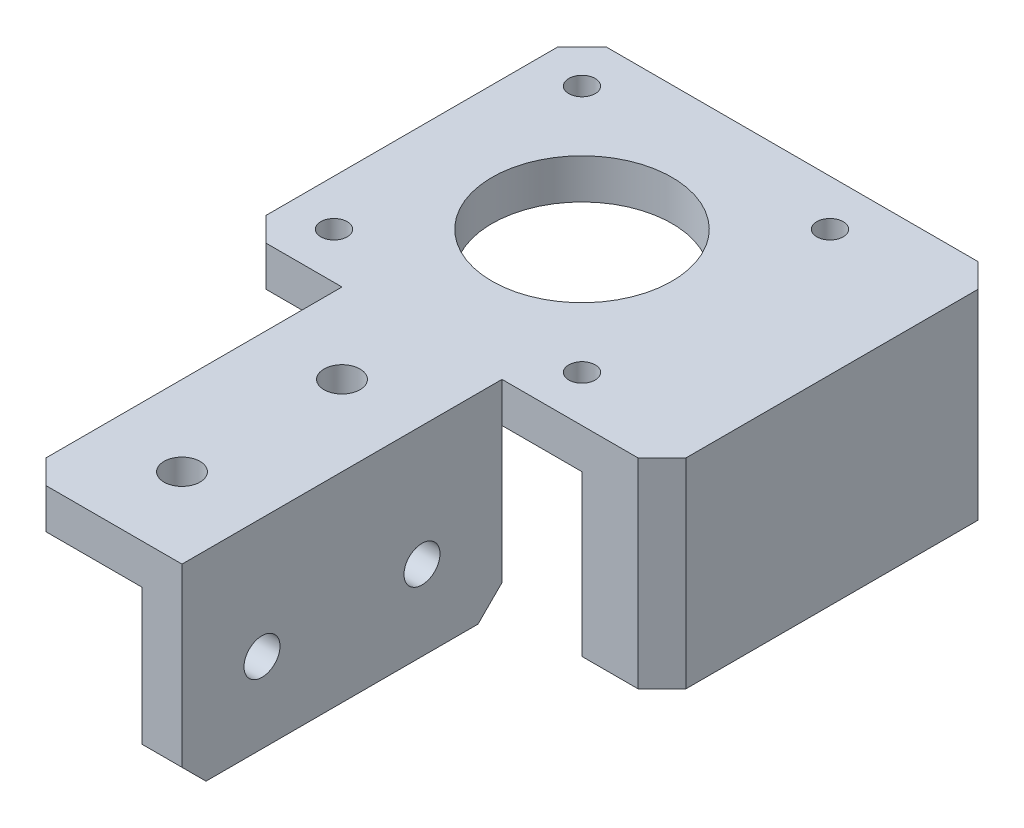
ISO-10303-21;
HEADER;
FILE_DESCRIPTION(('STEP AP214'),'2;1');
FILE_NAME('part.step','',(''),(''),'','','');
FILE_SCHEMA(('AUTOMOTIVE_DESIGN { 1 0 10303 214 1 1 1 1 }'));
ENDSEC;
DATA;
#1=APPLICATION_CONTEXT('core data for automotive mechanical design processes');
#2=APPLICATION_PROTOCOL_DEFINITION('international standard','automotive_design',2000,#1);
#3=PRODUCT_CONTEXT('',#1,'mechanical');
#4=PRODUCT('Part','Part','',(#3));
#5=PRODUCT_RELATED_PRODUCT_CATEGORY('part','',(#4));
#6=PRODUCT_DEFINITION_FORMATION('','',#4);
#7=PRODUCT_DEFINITION_CONTEXT('part definition',#1,'design');
#8=PRODUCT_DEFINITION('design','',#6,#7);
#9=PRODUCT_DEFINITION_SHAPE('','',#8);
#10=(LENGTH_UNIT() NAMED_UNIT(*) SI_UNIT(.MILLI.,.METRE.));
#11=(NAMED_UNIT(*) PLANE_ANGLE_UNIT() SI_UNIT($,.RADIAN.));
#12=(NAMED_UNIT(*) SI_UNIT($,.STERADIAN.) SOLID_ANGLE_UNIT());
#13=UNCERTAINTY_MEASURE_WITH_UNIT(LENGTH_MEASURE(1.E-05),#10,'distance_accuracy_value','');
#14=(GEOMETRIC_REPRESENTATION_CONTEXT(3) GLOBAL_UNCERTAINTY_ASSIGNED_CONTEXT((#13)) GLOBAL_UNIT_ASSIGNED_CONTEXT((#10,
#11,#12)) REPRESENTATION_CONTEXT('',''));
#15=CARTESIAN_POINT('',(0.,0.,0.));
#16=DIRECTION('',(0.,0.,1.));
#17=DIRECTION('',(1.,0.,0.));
#18=AXIS2_PLACEMENT_3D('',#15,#16,#17);
#19=CARTESIAN_POINT('',(31.251,-10.,31.25));
#20=DIRECTION('',(-1.,0.,0.));
#21=DIRECTION('',(0.,0.,1.));
#22=AXIS2_PLACEMENT_3D('',#19,#20,#21);
#23=CYLINDRICAL_SURFACE('',#22,2.25);
#24=CARTESIAN_POINT('',(11.25,-10.,31.25));
#25=DIRECTION('',(1.,0.,0.));
#26=DIRECTION('',(0.,0.,-1.));
#27=AXIS2_PLACEMENT_3D('',#24,#25,#26);
#28=CIRCLE('',#27,2.25);
#29=CARTESIAN_POINT('',(11.25,-10.,29.));
#30=VERTEX_POINT('',#29);
#31=EDGE_CURVE('E326',#30,#30,#28,.F.);
#32=ORIENTED_EDGE('',*,*,#31,.F.);
#33=EDGE_LOOP('',(#32));
#34=FACE_BOUND('',#33,.T.);
#35=CARTESIAN_POINT('',(7.25,-10.,31.25));
#36=DIRECTION('',(-1.,0.,0.));
#37=DIRECTION('',(0.,0.,1.));
#38=AXIS2_PLACEMENT_3D('',#35,#36,#37);
#39=CIRCLE('',#38,2.25);
#40=CARTESIAN_POINT('',(7.25,-10.,33.5));
#41=VERTEX_POINT('',#40);
#42=EDGE_CURVE('E330',#41,#41,#39,.F.);
#43=ORIENTED_EDGE('',*,*,#42,.F.);
#44=EDGE_LOOP('',(#43));
#45=FACE_BOUND('',#44,.T.);
#46=ADVANCED_FACE('F34',(#34,#45),#23,.F.);
#47=CARTESIAN_POINT('',(31.251,-10.,51.25));
#48=DIRECTION('',(-1.,0.,0.));
#49=DIRECTION('',(0.,0.,1.));
#50=AXIS2_PLACEMENT_3D('',#47,#48,#49);
#51=CYLINDRICAL_SURFACE('',#50,2.25);
#52=CARTESIAN_POINT('',(11.25,-10.,51.25));
#53=DIRECTION('',(1.,0.,0.));
#54=DIRECTION('',(0.,0.,-1.));
#55=AXIS2_PLACEMENT_3D('',#52,#53,#54);
#56=CIRCLE('',#55,2.25);
#57=CARTESIAN_POINT('',(11.25,-10.,49.));
#58=VERTEX_POINT('',#57);
#59=EDGE_CURVE('E378',#58,#58,#56,.F.);
#60=ORIENTED_EDGE('',*,*,#59,.F.);
#61=EDGE_LOOP('',(#60));
#62=FACE_BOUND('',#61,.T.);
#63=CARTESIAN_POINT('',(7.25,-10.,51.25));
#64=DIRECTION('',(-1.,0.,0.));
#65=DIRECTION('',(0.,0.,1.));
#66=AXIS2_PLACEMENT_3D('',#63,#64,#65);
#67=CIRCLE('',#66,2.25);
#68=CARTESIAN_POINT('',(7.25,-10.,53.5));
#69=VERTEX_POINT('',#68);
#70=EDGE_CURVE('E327',#69,#69,#67,.F.);
#71=ORIENTED_EDGE('',*,*,#70,.F.);
#72=EDGE_LOOP('',(#71));
#73=FACE_BOUND('',#72,.T.);
#74=ADVANCED_FACE('F440',(#62,#73),#51,.F.);
#75=CARTESIAN_POINT('',(1.25,-20.001,31.25));
#76=DIRECTION('',(0.,1.,0.));
#77=DIRECTION('',(0.,0.,1.));
#78=AXIS2_PLACEMENT_3D('',#75,#76,#77);
#79=CYLINDRICAL_SURFACE('',#78,2.25);
#80=CARTESIAN_POINT('',(1.25,5.,31.25));
#81=DIRECTION('',(0.,1.,0.));
#82=DIRECTION('',(0.,0.,-1.));
#83=AXIS2_PLACEMENT_3D('',#80,#81,#82);
#84=CIRCLE('',#83,2.25);
#85=CARTESIAN_POINT('',(1.25,5.,29.));
#86=VERTEX_POINT('',#85);
#87=EDGE_CURVE('E375',#86,#86,#84,.T.);
#88=ORIENTED_EDGE('',*,*,#87,.T.);
#89=EDGE_LOOP('',(#88));
#90=FACE_BOUND('',#89,.T.);
#91=CARTESIAN_POINT('',(1.25,1.,31.25));
#92=DIRECTION('',(0.,-1.,0.));
#93=DIRECTION('',(0.,0.,-1.));
#94=AXIS2_PLACEMENT_3D('',#91,#92,#93);
#95=CIRCLE('',#94,2.25);
#96=CARTESIAN_POINT('',(1.25,1.,29.));
#97=VERTEX_POINT('',#96);
#98=EDGE_CURVE('E322',#97,#97,#95,.F.);
#99=ORIENTED_EDGE('',*,*,#98,.F.);
#100=EDGE_LOOP('',(#99));
#101=FACE_BOUND('',#100,.T.);
#102=ADVANCED_FACE('F447',(#90,#101),#79,.F.);
#103=CARTESIAN_POINT('',(1.25,-20.001,51.25));
#104=DIRECTION('',(0.,1.,0.));
#105=DIRECTION('',(0.,0.,1.));
#106=AXIS2_PLACEMENT_3D('',#103,#104,#105);
#107=CYLINDRICAL_SURFACE('',#106,2.25);
#108=CARTESIAN_POINT('',(1.25,5.,51.25));
#109=DIRECTION('',(0.,1.,0.));
#110=DIRECTION('',(0.,0.,1.));
#111=AXIS2_PLACEMENT_3D('',#108,#109,#110);
#112=CIRCLE('',#111,2.25);
#113=CARTESIAN_POINT('',(1.25,5.,53.5));
#114=VERTEX_POINT('',#113);
#115=EDGE_CURVE('E368',#114,#114,#112,.T.);
#116=ORIENTED_EDGE('',*,*,#115,.T.);
#117=EDGE_LOOP('',(#116));
#118=FACE_BOUND('',#117,.T.);
#119=CARTESIAN_POINT('',(1.25,1.,51.25));
#120=DIRECTION('',(0.,-1.,0.));
#121=DIRECTION('',(0.,0.,-1.));
#122=AXIS2_PLACEMENT_3D('',#119,#120,#121);
#123=CIRCLE('',#122,2.25);
#124=CARTESIAN_POINT('',(1.25,1.,49.));
#125=VERTEX_POINT('',#124);
#126=EDGE_CURVE('E319',#125,#125,#123,.F.);
#127=ORIENTED_EDGE('',*,*,#126,.F.);
#128=EDGE_LOOP('',(#127));
#129=FACE_BOUND('',#128,.T.);
#130=ADVANCED_FACE('F454',(#118,#129),#107,.F.);
#131=CARTESIAN_POINT('',(-21.25,5.,21.25));
#132=DIRECTION('',(0.,0.,-1.));
#133=DIRECTION('',(-1.,0.,0.));
#134=AXIS2_PLACEMENT_3D('',#131,#132,#133);
#135=PLANE('',#134);
#136=DIRECTION('',(0.,-1.,0.));
#137=VECTOR('',#136,1.);
#138=CARTESIAN_POINT('',(-8.75,0.,21.25));
#139=LINE('',#138,#137);
#140=CARTESIAN_POINT('',(-8.75,5.,21.25));
#141=VERTEX_POINT('',#140);
#142=CARTESIAN_POINT('',(-8.75,0.,21.25));
#143=VERTEX_POINT('',#142);
#144=EDGE_CURVE('E367',#141,#143,#139,.T.);
#145=ORIENTED_EDGE('',*,*,#144,.F.);
#146=DIRECTION('',(1.,0.,0.));
#147=VECTOR('',#146,1.);
#148=CARTESIAN_POINT('',(-21.25,5.,21.25));
#149=LINE('',#148,#147);
#150=CARTESIAN_POINT('',(-18.25,5.,21.25));
#151=VERTEX_POINT('',#150);
#152=EDGE_CURVE('E268',#151,#141,#149,.T.);
#153=ORIENTED_EDGE('',*,*,#152,.F.);
#154=DIRECTION('',(0.,-1.,0.));
#155=VECTOR('',#154,1.);
#156=CARTESIAN_POINT('',(-18.25,5.,21.25));
#157=LINE('',#156,#155);
#158=CARTESIAN_POINT('',(-18.25,0.,21.25));
#159=VERTEX_POINT('',#158);
#160=EDGE_CURVE('E315',#151,#159,#157,.T.);
#161=ORIENTED_EDGE('',*,*,#160,.T.);
#162=DIRECTION('',(1.,0.,0.));
#163=VECTOR('',#162,1.);
#164=CARTESIAN_POINT('',(-21.25,0.,21.25));
#165=LINE('',#164,#163);
#166=EDGE_CURVE('E264',#159,#143,#165,.T.);
#167=ORIENTED_EDGE('',*,*,#166,.T.);
#168=EDGE_LOOP('',(#145,#153,#161,#167));
#169=FACE_BOUND('',#168,.T.);
#170=ADVANCED_FACE('F420',(#169),#135,.F.);
#171=CARTESIAN_POINT('',(6.25,-20.,21.25));
#172=DIRECTION('',(-1.,0.,0.));
#173=DIRECTION('',(0.,0.,1.));
#174=AXIS2_PLACEMENT_3D('',#171,#172,#173);
#175=PLANE('',#174);
#176=CARTESIAN_POINT('',(6.25,-10.,31.25));
#177=DIRECTION('',(-1.,0.,0.));
#178=DIRECTION('',(0.,0.,1.));
#179=AXIS2_PLACEMENT_3D('',#176,#177,#178);
#180=CIRCLE('',#179,3.75);
#181=CARTESIAN_POINT('',(6.25,-10.,35.));
#182=VERTEX_POINT('',#181);
#183=EDGE_CURVE('E401',#182,#182,#180,.T.);
#184=ORIENTED_EDGE('',*,*,#183,.F.);
#185=EDGE_LOOP('',(#184));
#186=FACE_BOUND('',#185,.T.);
#187=CARTESIAN_POINT('',(6.25,-10.,51.25));
#188=DIRECTION('',(-1.,0.,0.));
#189=DIRECTION('',(0.,0.,1.));
#190=AXIS2_PLACEMENT_3D('',#187,#188,#189);
#191=CIRCLE('',#190,3.75000000000001);
#192=CARTESIAN_POINT('',(6.25,-10.,55.));
#193=VERTEX_POINT('',#192);
#194=EDGE_CURVE('E395',#193,#193,#191,.T.);
#195=ORIENTED_EDGE('',*,*,#194,.F.);
#196=EDGE_LOOP('',(#195));
#197=FACE_BOUND('',#196,.T.);
#198=DIRECTION('',(0.,0.,1.));
#199=VECTOR('',#198,1.);
#200=CARTESIAN_POINT('',(6.25,-20.,21.25));
#201=LINE('',#200,#199);
#202=CARTESIAN_POINT('',(6.25,-20.,24.25));
#203=VERTEX_POINT('',#202);
#204=CARTESIAN_POINT('',(6.25,-20.,58.25));
#205=VERTEX_POINT('',#204);
#206=EDGE_CURVE('E199',#203,#205,#201,.T.);
#207=ORIENTED_EDGE('',*,*,#206,.T.);
#208=DIRECTION('',(0.,0.707106781186548,0.707106781186548));
#209=VECTOR('',#208,1.);
#210=CARTESIAN_POINT('',(6.25,-38.5,39.75));
#211=LINE('',#210,#209);
#212=CARTESIAN_POINT('',(6.25,-17.,61.25));
#213=VERTEX_POINT('',#212);
#214=EDGE_CURVE('E43',#205,#213,#211,.T.);
#215=ORIENTED_EDGE('',*,*,#214,.T.);
#216=DIRECTION('',(0.,1.,0.));
#217=VECTOR('',#216,1.);
#218=CARTESIAN_POINT('',(6.25,-20.,61.25));
#219=LINE('',#218,#217);
#220=CARTESIAN_POINT('',(6.25,0.,61.25));
#221=VERTEX_POINT('',#220);
#222=EDGE_CURVE('E183',#213,#221,#219,.T.);
#223=ORIENTED_EDGE('',*,*,#222,.T.);
#224=DIRECTION('',(0.,0.,1.));
#225=VECTOR('',#224,1.);
#226=CARTESIAN_POINT('',(6.25,0.,21.25));
#227=LINE('',#226,#225);
#228=CARTESIAN_POINT('',(6.25,0.,21.25));
#229=VERTEX_POINT('',#228);
#230=EDGE_CURVE('E365',#229,#221,#227,.T.);
#231=ORIENTED_EDGE('',*,*,#230,.F.);
#232=DIRECTION('',(0.,1.,0.));
#233=VECTOR('',#232,1.);
#234=CARTESIAN_POINT('',(6.25,-20.,21.25));
#235=LINE('',#234,#233);
#236=CARTESIAN_POINT('',(6.25,-17.,21.25));
#237=VERTEX_POINT('',#236);
#238=EDGE_CURVE('E205',#237,#229,#235,.T.);
#239=ORIENTED_EDGE('',*,*,#238,.F.);
#240=DIRECTION('',(0.,-0.707106781186548,0.707106781186548));
#241=VECTOR('',#240,1.);
#242=CARTESIAN_POINT('',(6.25,-18.5,22.75));
#243=LINE('',#242,#241);
#244=EDGE_CURVE('E50',#237,#203,#243,.T.);
#245=ORIENTED_EDGE('',*,*,#244,.T.);
#246=EDGE_LOOP('',(#207,#215,#223,#231,#239,#245));
#247=FACE_BOUND('',#246,.T.);
#248=ADVANCED_FACE('F352',(#186,#197,#247),#175,.T.);
#249=DIRECTION('',(1.,0.,0.));
#250=VECTOR('',#249,1.);
#251=CARTESIAN_POINT('',(21.25,-20.,21.25));
#252=LINE('',#251,#250);
#253=CARTESIAN_POINT('',(21.25,-20.,21.25));
#254=VERTEX_POINT('',#253);
#255=CARTESIAN_POINT('',(28.25,-20.,21.25));
#256=VERTEX_POINT('',#255);
#257=EDGE_CURVE('E215',#254,#256,#252,.T.);
#258=ORIENTED_EDGE('',*,*,#257,.T.);
#259=DIRECTION('',(0.,1.,0.));
#260=VECTOR('',#259,1.);
#261=CARTESIAN_POINT('',(28.25,5.,21.25));
#262=LINE('',#261,#260);
#263=CARTESIAN_POINT('',(28.25,5.,21.25));
#264=VERTEX_POINT('',#263);
#265=EDGE_CURVE('E282',#256,#264,#262,.T.);
#266=ORIENTED_EDGE('',*,*,#265,.T.);
#267=CARTESIAN_POINT('',(11.25,5.,21.25));
#268=VERTEX_POINT('',#267);
#269=EDGE_CURVE('E267',#268,#264,#149,.T.);
#270=ORIENTED_EDGE('',*,*,#269,.F.);
#271=DIRECTION('',(0.,1.,0.));
#272=VECTOR('',#271,1.);
#273=CARTESIAN_POINT('',(11.25,-20.,21.25));
#274=LINE('',#273,#272);
#275=CARTESIAN_POINT('',(11.25,0.,21.25));
#276=VERTEX_POINT('',#275);
#277=EDGE_CURVE('E198',#276,#268,#274,.T.);
#278=ORIENTED_EDGE('',*,*,#277,.F.);
#279=CARTESIAN_POINT('',(21.25,0.,21.25));
#280=VERTEX_POINT('',#279);
#281=EDGE_CURVE('E279',#276,#280,#165,.T.);
#282=ORIENTED_EDGE('',*,*,#281,.T.);
#283=DIRECTION('',(0.,1.,0.));
#284=VECTOR('',#283,1.);
#285=CARTESIAN_POINT('',(21.25,-20.,21.25));
#286=LINE('',#285,#284);
#287=EDGE_CURVE('E224',#254,#280,#286,.T.);
#288=ORIENTED_EDGE('',*,*,#287,.F.);
#289=EDGE_LOOP('',(#258,#266,#270,#278,#282,#288));
#290=FACE_BOUND('',#289,.T.);
#291=ADVANCED_FACE('F419',(#290),#135,.F.);
#292=CARTESIAN_POINT('',(0.,5.,0.));
#293=DIRECTION('',(0.,-1.,0.));
#294=DIRECTION('',(0.,0.,-1.));
#295=AXIS2_PLACEMENT_3D('',#292,#293,#294);
#296=PLANE('',#295);
#297=ORIENTED_EDGE('',*,*,#115,.F.);
#298=EDGE_LOOP('',(#297));
#299=FACE_BOUND('',#298,.T.);
#300=ORIENTED_EDGE('',*,*,#87,.F.);
#301=EDGE_LOOP('',(#300));
#302=FACE_BOUND('',#301,.T.);
#303=DIRECTION('',(0.,0.,-1.));
#304=VECTOR('',#303,1.);
#305=CARTESIAN_POINT('',(-8.75,5.,21.25));
#306=LINE('',#305,#304);
#307=CARTESIAN_POINT('',(-8.74999999999999,5.,58.25));
#308=VERTEX_POINT('',#307);
#309=EDGE_CURVE('E364',#308,#141,#306,.T.);
#310=ORIENTED_EDGE('',*,*,#309,.F.);
#311=DIRECTION('',(0.707106781186549,0.,0.707106781186546));
#312=VECTOR('',#311,1.);
#313=CARTESIAN_POINT('',(-8.74999999999999,5.,58.25));
#314=LINE('',#313,#312);
#315=CARTESIAN_POINT('',(-5.74999999999996,5.,61.25));
#316=VERTEX_POINT('',#315);
#317=EDGE_CURVE('E193',#308,#316,#314,.T.);
#318=ORIENTED_EDGE('',*,*,#317,.T.);
#319=DIRECTION('',(1.,0.,0.));
#320=VECTOR('',#319,1.);
#321=CARTESIAN_POINT('',(6.25,5.,61.25));
#322=LINE('',#321,#320);
#323=CARTESIAN_POINT('',(11.25,5.,61.25));
#324=VERTEX_POINT('',#323);
#325=EDGE_CURVE('E175',#316,#324,#322,.T.);
#326=ORIENTED_EDGE('',*,*,#325,.T.);
#327=DIRECTION('',(0.,0.,-1.));
#328=VECTOR('',#327,1.);
#329=CARTESIAN_POINT('',(11.25,5.,21.25));
#330=LINE('',#329,#328);
#331=EDGE_CURVE('E191',#324,#268,#330,.T.);
#332=ORIENTED_EDGE('',*,*,#331,.T.);
#333=ORIENTED_EDGE('',*,*,#269,.T.);
#334=DIRECTION('',(0.707106781186547,0.,-0.707106781186548));
#335=VECTOR('',#334,1.);
#336=CARTESIAN_POINT('',(28.25,5.,21.25));
#337=LINE('',#336,#335);
#338=CARTESIAN_POINT('',(31.25,5.,18.25));
#339=VERTEX_POINT('',#338);
#340=EDGE_CURVE('E291',#264,#339,#337,.T.);
#341=ORIENTED_EDGE('',*,*,#340,.T.);
#342=DIRECTION('',(0.,0.,-1.));
#343=VECTOR('',#342,1.);
#344=CARTESIAN_POINT('',(31.25,5.,21.25));
#345=LINE('',#344,#343);
#346=CARTESIAN_POINT('',(31.25,5.,-18.25));
#347=VERTEX_POINT('',#346);
#348=EDGE_CURVE('E207',#339,#347,#345,.T.);
#349=ORIENTED_EDGE('',*,*,#348,.T.);
#350=DIRECTION('',(-0.707106781186547,0.,-0.707106781186548));
#351=VECTOR('',#350,1.);
#352=CARTESIAN_POINT('',(31.25,5.,-18.25));
#353=LINE('',#352,#351);
#354=CARTESIAN_POINT('',(28.25,5.,-21.25));
#355=VERTEX_POINT('',#354);
#356=EDGE_CURVE('E289',#347,#355,#353,.T.);
#357=ORIENTED_EDGE('',*,*,#356,.T.);
#358=DIRECTION('',(-1.,0.,0.));
#359=VECTOR('',#358,1.);
#360=CARTESIAN_POINT('',(-21.25,5.,-21.25));
#361=LINE('',#360,#359);
#362=CARTESIAN_POINT('',(-18.25,5.,-21.25));
#363=VERTEX_POINT('',#362);
#364=EDGE_CURVE('E260',#355,#363,#361,.T.);
#365=ORIENTED_EDGE('',*,*,#364,.T.);
#366=DIRECTION('',(0.707106781186548,0.,-0.707106781186548));
#367=VECTOR('',#366,1.);
#368=CARTESIAN_POINT('',(-21.25,5.,-18.25));
#369=LINE('',#368,#367);
#370=CARTESIAN_POINT('',(-21.25,5.,-18.25));
#371=VERTEX_POINT('',#370);
#372=EDGE_CURVE('E287',#363,#371,#369,.F.);
#373=ORIENTED_EDGE('',*,*,#372,.T.);
#374=DIRECTION('',(0.,0.,1.));
#375=VECTOR('',#374,1.);
#376=CARTESIAN_POINT('',(-21.25,5.,21.25));
#377=LINE('',#376,#375);
#378=CARTESIAN_POINT('',(-21.25,5.,18.25));
#379=VERTEX_POINT('',#378);
#380=EDGE_CURVE('E263',#371,#379,#377,.T.);
#381=ORIENTED_EDGE('',*,*,#380,.T.);
#382=DIRECTION('',(-0.707106781186548,0.,-0.707106781186548));
#383=VECTOR('',#382,1.);
#384=CARTESIAN_POINT('',(-18.25,5.,21.25));
#385=LINE('',#384,#383);
#386=EDGE_CURVE('E285',#379,#151,#385,.F.);
#387=ORIENTED_EDGE('',*,*,#386,.T.);
#388=ORIENTED_EDGE('',*,*,#152,.T.);
#389=EDGE_LOOP('',(#310,#318,#326,#332,#333,#341,#349,#357,#365,#373,#381,#387,#388));
#390=FACE_BOUND('',#389,.T.);
#391=CARTESIAN_POINT('',(0.,5.,0.));
#392=DIRECTION('',(0.,1.,0.));
#393=DIRECTION('',(0.,0.,1.));
#394=AXIS2_PLACEMENT_3D('',#391,#392,#393);
#395=CIRCLE('',#394,11.25);
#396=CARTESIAN_POINT('',(0.,5.,11.25));
#397=VERTEX_POINT('',#396);
#398=EDGE_CURVE('E254',#397,#397,#395,.T.);
#399=ORIENTED_EDGE('',*,*,#398,.F.);
#400=EDGE_LOOP('',(#399));
#401=FACE_BOUND('',#400,.T.);
#402=CARTESIAN_POINT('',(-15.5,5.,-15.5));
#403=DIRECTION('',(0.,1.,0.));
#404=DIRECTION('',(0.,0.,1.));
#405=AXIS2_PLACEMENT_3D('',#402,#403,#404);
#406=CIRCLE('',#405,1.65);
#407=CARTESIAN_POINT('',(-15.5,5.,-13.85));
#408=VERTEX_POINT('',#407);
#409=EDGE_CURVE('E248',#408,#408,#406,.T.);
#410=ORIENTED_EDGE('',*,*,#409,.F.);
#411=EDGE_LOOP('',(#410));
#412=FACE_BOUND('',#411,.T.);
#413=CARTESIAN_POINT('',(15.5,5.,-15.5));
#414=DIRECTION('',(0.,1.,0.));
#415=DIRECTION('',(0.,0.,-1.));
#416=AXIS2_PLACEMENT_3D('',#413,#414,#415);
#417=CIRCLE('',#416,1.65);
#418=CARTESIAN_POINT('',(15.5,5.,-17.15));
#419=VERTEX_POINT('',#418);
#420=EDGE_CURVE('E242',#419,#419,#417,.T.);
#421=ORIENTED_EDGE('',*,*,#420,.F.);
#422=EDGE_LOOP('',(#421));
#423=FACE_BOUND('',#422,.T.);
#424=CARTESIAN_POINT('',(15.5,5.,15.5));
#425=DIRECTION('',(0.,1.,0.));
#426=DIRECTION('',(0.,0.,1.));
#427=AXIS2_PLACEMENT_3D('',#424,#425,#426);
#428=CIRCLE('',#427,1.65);
#429=CARTESIAN_POINT('',(15.5,5.,17.15));
#430=VERTEX_POINT('',#429);
#431=EDGE_CURVE('E236',#430,#430,#428,.T.);
#432=ORIENTED_EDGE('',*,*,#431,.F.);
#433=EDGE_LOOP('',(#432));
#434=FACE_BOUND('',#433,.T.);
#435=CARTESIAN_POINT('',(-15.5,5.,15.5));
#436=DIRECTION('',(0.,1.,0.));
#437=DIRECTION('',(0.,0.,-1.));
#438=AXIS2_PLACEMENT_3D('',#435,#436,#437);
#439=CIRCLE('',#438,1.65);
#440=CARTESIAN_POINT('',(-15.5,5.,13.85));
#441=VERTEX_POINT('',#440);
#442=EDGE_CURVE('E230',#441,#441,#439,.T.);
#443=ORIENTED_EDGE('',*,*,#442,.F.);
#444=EDGE_LOOP('',(#443));
#445=FACE_BOUND('',#444,.T.);
#446=ADVANCED_FACE('F188',(#299,#302,#390,#401,#412,#423,#434,#445),#296,.F.);
#447=CARTESIAN_POINT('',(0.,0.,0.));
#448=DIRECTION('',(0.,-1.,0.));
#449=DIRECTION('',(0.,0.,-1.));
#450=AXIS2_PLACEMENT_3D('',#447,#448,#449);
#451=PLANE('',#450);
#452=CARTESIAN_POINT('',(1.25,0.,51.25));
#453=DIRECTION('',(0.,-1.,0.));
#454=DIRECTION('',(0.,0.,-1.));
#455=AXIS2_PLACEMENT_3D('',#452,#453,#454);
#456=CIRCLE('',#455,3.75);
#457=CARTESIAN_POINT('',(1.25,0.,47.5));
#458=VERTEX_POINT('',#457);
#459=EDGE_CURVE('E390',#458,#458,#456,.T.);
#460=ORIENTED_EDGE('',*,*,#459,.F.);
#461=EDGE_LOOP('',(#460));
#462=FACE_BOUND('',#461,.T.);
#463=CARTESIAN_POINT('',(1.25000000000021,0.,31.25));
#464=DIRECTION('',(0.,-1.,0.));
#465=DIRECTION('',(0.,0.,-1.));
#466=AXIS2_PLACEMENT_3D('',#463,#464,#465);
#467=CIRCLE('',#466,3.75);
#468=CARTESIAN_POINT('',(1.25000000000021,0.,27.5));
#469=VERTEX_POINT('',#468);
#470=EDGE_CURVE('E334',#469,#469,#467,.T.);
#471=ORIENTED_EDGE('',*,*,#470,.F.);
#472=EDGE_LOOP('',(#471));
#473=FACE_BOUND('',#472,.T.);
#474=CARTESIAN_POINT('',(15.5,0.,15.5));
#475=DIRECTION('',(0.,1.,0.));
#476=DIRECTION('',(0.,0.,1.));
#477=AXIS2_PLACEMENT_3D('',#474,#475,#476);
#478=CIRCLE('',#477,1.65);
#479=CARTESIAN_POINT('',(15.5,0.,17.15));
#480=VERTEX_POINT('',#479);
#481=EDGE_CURVE('E233',#480,#480,#478,.T.);
#482=ORIENTED_EDGE('',*,*,#481,.T.);
#483=EDGE_LOOP('',(#482));
#484=FACE_BOUND('',#483,.T.);
#485=CARTESIAN_POINT('',(-15.5,0.,-15.5));
#486=DIRECTION('',(0.,1.,0.));
#487=DIRECTION('',(0.,0.,1.));
#488=AXIS2_PLACEMENT_3D('',#485,#486,#487);
#489=CIRCLE('',#488,1.65);
#490=CARTESIAN_POINT('',(-15.5,0.,-13.85));
#491=VERTEX_POINT('',#490);
#492=EDGE_CURVE('E245',#491,#491,#489,.T.);
#493=ORIENTED_EDGE('',*,*,#492,.T.);
#494=EDGE_LOOP('',(#493));
#495=FACE_BOUND('',#494,.T.);
#496=DIRECTION('',(1.,0.,0.));
#497=VECTOR('',#496,1.);
#498=CARTESIAN_POINT('',(-8.74999999999999,0.,61.25));
#499=LINE('',#498,#497);
#500=CARTESIAN_POINT('',(-5.74999999999996,0.,61.25));
#501=VERTEX_POINT('',#500);
#502=EDGE_CURVE('E194',#501,#221,#499,.T.);
#503=ORIENTED_EDGE('',*,*,#502,.F.);
#504=DIRECTION('',(-0.707106781186549,0.,-0.707106781186546));
#505=VECTOR('',#504,1.);
#506=CARTESIAN_POINT('',(-33.5,0.,33.5000000000001));
#507=LINE('',#506,#505);
#508=CARTESIAN_POINT('',(-8.74999999999999,0.,58.25));
#509=VERTEX_POINT('',#508);
#510=EDGE_CURVE('E341',#501,#509,#507,.T.);
#511=ORIENTED_EDGE('',*,*,#510,.T.);
#512=DIRECTION('',(0.,0.,1.));
#513=VECTOR('',#512,1.);
#514=CARTESIAN_POINT('',(-8.75,0.,21.25));
#515=LINE('',#514,#513);
#516=EDGE_CURVE('E370',#143,#509,#515,.T.);
#517=ORIENTED_EDGE('',*,*,#516,.F.);
#518=ORIENTED_EDGE('',*,*,#166,.F.);
#519=DIRECTION('',(0.707106781186548,0.,0.707106781186548));
#520=VECTOR('',#519,1.);
#521=CARTESIAN_POINT('',(-19.75,0.,19.75));
#522=LINE('',#521,#520);
#523=CARTESIAN_POINT('',(-21.25,0.,18.25));
#524=VERTEX_POINT('',#523);
#525=EDGE_CURVE('E311',#159,#524,#522,.F.);
#526=ORIENTED_EDGE('',*,*,#525,.T.);
#527=DIRECTION('',(0.,0.,1.));
#528=VECTOR('',#527,1.);
#529=CARTESIAN_POINT('',(-21.25,0.,21.25));
#530=LINE('',#529,#528);
#531=CARTESIAN_POINT('',(-21.25,0.,-18.25));
#532=VERTEX_POINT('',#531);
#533=EDGE_CURVE('E276',#532,#524,#530,.T.);
#534=ORIENTED_EDGE('',*,*,#533,.F.);
#535=DIRECTION('',(-0.707106781186548,0.,0.707106781186548));
#536=VECTOR('',#535,1.);
#537=CARTESIAN_POINT('',(-19.75,0.,-19.75));
#538=LINE('',#537,#536);
#539=CARTESIAN_POINT('',(-18.25,0.,-21.25));
#540=VERTEX_POINT('',#539);
#541=EDGE_CURVE('E313',#532,#540,#538,.F.);
#542=ORIENTED_EDGE('',*,*,#541,.T.);
#543=DIRECTION('',(-1.,0.,0.));
#544=VECTOR('',#543,1.);
#545=CARTESIAN_POINT('',(-21.25,0.,-21.25));
#546=LINE('',#545,#544);
#547=CARTESIAN_POINT('',(21.25,0.,-21.25));
#548=VERTEX_POINT('',#547);
#549=EDGE_CURVE('E273',#548,#540,#546,.T.);
#550=ORIENTED_EDGE('',*,*,#549,.F.);
#551=DIRECTION('',(0.,0.,-1.));
#552=VECTOR('',#551,1.);
#553=CARTESIAN_POINT('',(21.25,0.,21.25));
#554=LINE('',#553,#552);
#555=EDGE_CURVE('E257',#280,#548,#554,.T.);
#556=ORIENTED_EDGE('',*,*,#555,.F.);
#557=ORIENTED_EDGE('',*,*,#281,.F.);
#558=EDGE_CURVE('E281',#229,#276,#165,.T.);
#559=ORIENTED_EDGE('',*,*,#558,.F.);
#560=ORIENTED_EDGE('',*,*,#230,.T.);
#561=EDGE_LOOP('',(#503,#511,#517,#518,#526,#534,#542,#550,#556,#557,#559,#560));
#562=FACE_BOUND('',#561,.T.);
#563=CARTESIAN_POINT('',(0.,0.,0.));
#564=DIRECTION('',(0.,1.,0.));
#565=DIRECTION('',(0.,0.,1.));
#566=AXIS2_PLACEMENT_3D('',#563,#564,#565);
#567=CIRCLE('',#566,11.25);
#568=CARTESIAN_POINT('',(0.,0.,11.25));
#569=VERTEX_POINT('',#568);
#570=EDGE_CURVE('E251',#569,#569,#567,.T.);
#571=ORIENTED_EDGE('',*,*,#570,.T.);
#572=EDGE_LOOP('',(#571));
#573=FACE_BOUND('',#572,.T.);
#574=CARTESIAN_POINT('',(15.5,0.,-15.5));
#575=DIRECTION('',(0.,1.,0.));
#576=DIRECTION('',(0.,0.,-1.));
#577=AXIS2_PLACEMENT_3D('',#574,#575,#576);
#578=CIRCLE('',#577,1.65);
#579=CARTESIAN_POINT('',(15.5,0.,-17.15));
#580=VERTEX_POINT('',#579);
#581=EDGE_CURVE('E239',#580,#580,#578,.T.);
#582=ORIENTED_EDGE('',*,*,#581,.T.);
#583=EDGE_LOOP('',(#582));
#584=FACE_BOUND('',#583,.T.);
#585=CARTESIAN_POINT('',(-15.5,0.,15.5));
#586=DIRECTION('',(0.,1.,0.));
#587=DIRECTION('',(0.,0.,-1.));
#588=AXIS2_PLACEMENT_3D('',#585,#586,#587);
#589=CIRCLE('',#588,1.65);
#590=CARTESIAN_POINT('',(-15.5,0.,13.85));
#591=VERTEX_POINT('',#590);
#592=EDGE_CURVE('E227',#591,#591,#589,.T.);
#593=ORIENTED_EDGE('',*,*,#592,.T.);
#594=EDGE_LOOP('',(#593));
#595=FACE_BOUND('',#594,.T.);
#596=ADVANCED_FACE('F514',(#462,#473,#484,#495,#562,#573,#584,#595),#451,.T.);
#597=CARTESIAN_POINT('',(-21.25,5.,-21.25));
#598=DIRECTION('',(0.,0.,1.));
#599=DIRECTION('',(1.,0.,0.));
#600=AXIS2_PLACEMENT_3D('',#597,#598,#599);
#601=PLANE('',#600);
#602=ORIENTED_EDGE('',*,*,#364,.F.);
#603=DIRECTION('',(0.,-1.,0.));
#604=VECTOR('',#603,1.);
#605=CARTESIAN_POINT('',(28.25,-20.,-21.25));
#606=LINE('',#605,#604);
#607=CARTESIAN_POINT('',(28.25,-20.,-21.25));
#608=VERTEX_POINT('',#607);
#609=EDGE_CURVE('E304',#355,#608,#606,.T.);
#610=ORIENTED_EDGE('',*,*,#609,.T.);
#611=DIRECTION('',(-1.,0.,0.));
#612=VECTOR('',#611,1.);
#613=CARTESIAN_POINT('',(21.25,-20.,-21.25));
#614=LINE('',#613,#612);
#615=CARTESIAN_POINT('',(21.25,-20.,-21.25));
#616=VERTEX_POINT('',#615);
#617=EDGE_CURVE('E210',#608,#616,#614,.T.);
#618=ORIENTED_EDGE('',*,*,#617,.T.);
#619=DIRECTION('',(0.,1.,0.));
#620=VECTOR('',#619,1.);
#621=CARTESIAN_POINT('',(21.25,-20.,-21.25));
#622=LINE('',#621,#620);
#623=EDGE_CURVE('E221',#616,#548,#622,.T.);
#624=ORIENTED_EDGE('',*,*,#623,.T.);
#625=ORIENTED_EDGE('',*,*,#549,.T.);
#626=DIRECTION('',(0.,1.,0.));
#627=VECTOR('',#626,1.);
#628=CARTESIAN_POINT('',(-18.25,5.,-21.25));
#629=LINE('',#628,#627);
#630=EDGE_CURVE('E302',#540,#363,#629,.T.);
#631=ORIENTED_EDGE('',*,*,#630,.T.);
#632=EDGE_LOOP('',(#602,#610,#618,#624,#625,#631));
#633=FACE_BOUND('',#632,.T.);
#634=ADVANCED_FACE('F518',(#633),#601,.F.);
#635=CARTESIAN_POINT('',(-21.25,5.,21.25));
#636=DIRECTION('',(1.,0.,0.));
#637=DIRECTION('',(0.,0.,-1.));
#638=AXIS2_PLACEMENT_3D('',#635,#636,#637);
#639=PLANE('',#638);
#640=ORIENTED_EDGE('',*,*,#380,.F.);
#641=DIRECTION('',(0.,-1.,0.));
#642=VECTOR('',#641,1.);
#643=CARTESIAN_POINT('',(-21.25,5.,-18.25));
#644=LINE('',#643,#642);
#645=EDGE_CURVE('E308',#371,#532,#644,.T.);
#646=ORIENTED_EDGE('',*,*,#645,.T.);
#647=ORIENTED_EDGE('',*,*,#533,.T.);
#648=DIRECTION('',(0.,1.,0.));
#649=VECTOR('',#648,1.);
#650=CARTESIAN_POINT('',(-21.25,5.,18.25));
#651=LINE('',#650,#649);
#652=EDGE_CURVE('E306',#524,#379,#651,.T.);
#653=ORIENTED_EDGE('',*,*,#652,.T.);
#654=EDGE_LOOP('',(#640,#646,#647,#653));
#655=FACE_BOUND('',#654,.T.);
#656=ADVANCED_FACE('F510',(#655),#639,.F.);
#657=CARTESIAN_POINT('',(0.,5.,0.));
#658=DIRECTION('',(0.,-1.,0.));
#659=DIRECTION('',(0.,0.,-1.));
#660=AXIS2_PLACEMENT_3D('',#657,#658,#659);
#661=CYLINDRICAL_SURFACE('',#660,11.25);
#662=ORIENTED_EDGE('',*,*,#398,.T.);
#663=EDGE_LOOP('',(#662));
#664=FACE_BOUND('',#663,.T.);
#665=ORIENTED_EDGE('',*,*,#570,.F.);
#666=EDGE_LOOP('',(#665));
#667=FACE_BOUND('',#666,.T.);
#668=ADVANCED_FACE('F506',(#664,#667),#661,.F.);
#669=CARTESIAN_POINT('',(-15.5,5.,-15.5));
#670=DIRECTION('',(0.,-1.,0.));
#671=DIRECTION('',(0.,0.,-1.));
#672=AXIS2_PLACEMENT_3D('',#669,#670,#671);
#673=CYLINDRICAL_SURFACE('',#672,1.65);
#674=ORIENTED_EDGE('',*,*,#409,.T.);
#675=EDGE_LOOP('',(#674));
#676=FACE_BOUND('',#675,.T.);
#677=ORIENTED_EDGE('',*,*,#492,.F.);
#678=EDGE_LOOP('',(#677));
#679=FACE_BOUND('',#678,.T.);
#680=ADVANCED_FACE('F502',(#676,#679),#673,.F.);
#681=CARTESIAN_POINT('',(15.5,5.,-15.5));
#682=DIRECTION('',(0.,-1.,0.));
#683=DIRECTION('',(0.,0.,-1.));
#684=AXIS2_PLACEMENT_3D('',#681,#682,#683);
#685=CYLINDRICAL_SURFACE('',#684,1.65);
#686=ORIENTED_EDGE('',*,*,#420,.T.);
#687=EDGE_LOOP('',(#686));
#688=FACE_BOUND('',#687,.T.);
#689=ORIENTED_EDGE('',*,*,#581,.F.);
#690=EDGE_LOOP('',(#689));
#691=FACE_BOUND('',#690,.T.);
#692=ADVANCED_FACE('F498',(#688,#691),#685,.F.);
#693=CARTESIAN_POINT('',(15.5,5.,15.5));
#694=DIRECTION('',(0.,-1.,0.));
#695=DIRECTION('',(0.,0.,-1.));
#696=AXIS2_PLACEMENT_3D('',#693,#694,#695);
#697=CYLINDRICAL_SURFACE('',#696,1.65);
#698=ORIENTED_EDGE('',*,*,#431,.T.);
#699=EDGE_LOOP('',(#698));
#700=FACE_BOUND('',#699,.T.);
#701=ORIENTED_EDGE('',*,*,#481,.F.);
#702=EDGE_LOOP('',(#701));
#703=FACE_BOUND('',#702,.T.);
#704=ADVANCED_FACE('F494',(#700,#703),#697,.F.);
#705=CARTESIAN_POINT('',(-15.5,5.,15.5));
#706=DIRECTION('',(0.,-1.,0.));
#707=DIRECTION('',(0.,0.,-1.));
#708=AXIS2_PLACEMENT_3D('',#705,#706,#707);
#709=CYLINDRICAL_SURFACE('',#708,1.65);
#710=ORIENTED_EDGE('',*,*,#442,.T.);
#711=EDGE_LOOP('',(#710));
#712=FACE_BOUND('',#711,.T.);
#713=ORIENTED_EDGE('',*,*,#592,.F.);
#714=EDGE_LOOP('',(#713));
#715=FACE_BOUND('',#714,.T.);
#716=ADVANCED_FACE('F487',(#712,#715),#709,.F.);
#717=CARTESIAN_POINT('',(31.25,-20.,21.25));
#718=DIRECTION('',(1.,0.,0.));
#719=DIRECTION('',(0.,0.,-1.));
#720=AXIS2_PLACEMENT_3D('',#717,#718,#719);
#721=PLANE('',#720);
#722=ORIENTED_EDGE('',*,*,#348,.F.);
#723=DIRECTION('',(0.,-1.,0.));
#724=VECTOR('',#723,1.);
#725=CARTESIAN_POINT('',(31.25,-20.,18.25));
#726=LINE('',#725,#724);
#727=CARTESIAN_POINT('',(31.25,-20.,18.25));
#728=VERTEX_POINT('',#727);
#729=EDGE_CURVE('E296',#339,#728,#726,.T.);
#730=ORIENTED_EDGE('',*,*,#729,.T.);
#731=DIRECTION('',(0.,0.,-1.));
#732=VECTOR('',#731,1.);
#733=CARTESIAN_POINT('',(31.25,-20.,21.25));
#734=LINE('',#733,#732);
#735=CARTESIAN_POINT('',(31.25,-20.,-18.25));
#736=VERTEX_POINT('',#735);
#737=EDGE_CURVE('E218',#728,#736,#734,.T.);
#738=ORIENTED_EDGE('',*,*,#737,.T.);
#739=DIRECTION('',(0.,1.,0.));
#740=VECTOR('',#739,1.);
#741=CARTESIAN_POINT('',(31.25,5.,-18.25));
#742=LINE('',#741,#740);
#743=EDGE_CURVE('E293',#736,#347,#742,.T.);
#744=ORIENTED_EDGE('',*,*,#743,.T.);
#745=EDGE_LOOP('',(#722,#730,#738,#744));
#746=FACE_BOUND('',#745,.T.);
#747=ADVANCED_FACE('F484',(#746),#721,.T.);
#748=CARTESIAN_POINT('',(21.25,-20.,21.25));
#749=DIRECTION('',(-1.,0.,0.));
#750=DIRECTION('',(0.,0.,1.));
#751=AXIS2_PLACEMENT_3D('',#748,#749,#750);
#752=PLANE('',#751);
#753=ORIENTED_EDGE('',*,*,#287,.T.);
#754=ORIENTED_EDGE('',*,*,#555,.T.);
#755=ORIENTED_EDGE('',*,*,#623,.F.);
#756=DIRECTION('',(0.,0.,1.));
#757=VECTOR('',#756,1.);
#758=CARTESIAN_POINT('',(21.25,-20.,21.25));
#759=LINE('',#758,#757);
#760=EDGE_CURVE('E212',#616,#254,#759,.T.);
#761=ORIENTED_EDGE('',*,*,#760,.T.);
#762=EDGE_LOOP('',(#753,#754,#755,#761));
#763=FACE_BOUND('',#762,.T.);
#764=ADVANCED_FACE('F482',(#763),#752,.T.);
#765=CARTESIAN_POINT('',(0.,-20.,0.));
#766=DIRECTION('',(0.,1.,0.));
#767=DIRECTION('',(0.,0.,1.));
#768=AXIS2_PLACEMENT_3D('',#765,#766,#767);
#769=PLANE('',#768);
#770=ORIENTED_EDGE('',*,*,#737,.F.);
#771=DIRECTION('',(-0.707106781186547,0.,0.707106781186548));
#772=VECTOR('',#771,1.);
#773=CARTESIAN_POINT('',(28.25,-20.,21.25));
#774=LINE('',#773,#772);
#775=EDGE_CURVE('E300',#728,#256,#774,.T.);
#776=ORIENTED_EDGE('',*,*,#775,.T.);
#777=ORIENTED_EDGE('',*,*,#257,.F.);
#778=ORIENTED_EDGE('',*,*,#760,.F.);
#779=ORIENTED_EDGE('',*,*,#617,.F.);
#780=DIRECTION('',(0.707106781186547,0.,0.707106781186548));
#781=VECTOR('',#780,1.);
#782=CARTESIAN_POINT('',(31.25,-20.,-18.25));
#783=LINE('',#782,#781);
#784=EDGE_CURVE('E298',#608,#736,#783,.T.);
#785=ORIENTED_EDGE('',*,*,#784,.T.);
#786=EDGE_LOOP('',(#770,#776,#777,#778,#779,#785));
#787=FACE_BOUND('',#786,.T.);
#788=ADVANCED_FACE('F473',(#787),#769,.F.);
#789=CARTESIAN_POINT('',(6.25,-20.,21.25));
#790=DIRECTION('',(0.,0.,-1.));
#791=DIRECTION('',(-1.,0.,0.));
#792=AXIS2_PLACEMENT_3D('',#789,#790,#791);
#793=PLANE('',#792);
#794=CARTESIAN_POINT('',(11.25,-17.,21.25));
#795=VERTEX_POINT('',#794);
#796=EDGE_CURVE('E182',#795,#276,#274,.T.);
#797=ORIENTED_EDGE('',*,*,#796,.F.);
#798=DIRECTION('',(-1.,0.,0.));
#799=VECTOR('',#798,1.);
#800=CARTESIAN_POINT('',(6.25,-17.,21.25));
#801=LINE('',#800,#799);
#802=EDGE_CURVE('E11',#795,#237,#801,.T.);
#803=ORIENTED_EDGE('',*,*,#802,.T.);
#804=ORIENTED_EDGE('',*,*,#238,.T.);
#805=ORIENTED_EDGE('',*,*,#558,.T.);
#806=EDGE_LOOP('',(#797,#803,#804,#805));
#807=FACE_BOUND('',#806,.T.);
#808=ADVANCED_FACE('F470',(#807),#793,.T.);
#809=CARTESIAN_POINT('',(11.25,-20.,21.25));
#810=DIRECTION('',(1.,0.,0.));
#811=DIRECTION('',(0.,0.,-1.));
#812=AXIS2_PLACEMENT_3D('',#809,#810,#811);
#813=PLANE('',#812);
#814=ORIENTED_EDGE('',*,*,#59,.T.);
#815=EDGE_LOOP('',(#814));
#816=FACE_BOUND('',#815,.T.);
#817=ORIENTED_EDGE('',*,*,#31,.T.);
#818=EDGE_LOOP('',(#817));
#819=FACE_BOUND('',#818,.T.);
#820=DIRECTION('',(0.,1.,0.));
#821=VECTOR('',#820,1.);
#822=CARTESIAN_POINT('',(11.25,-20.,61.25));
#823=LINE('',#822,#821);
#824=CARTESIAN_POINT('',(11.25,-17.,61.25));
#825=VERTEX_POINT('',#824);
#826=EDGE_CURVE('E172',#825,#324,#823,.T.);
#827=ORIENTED_EDGE('',*,*,#826,.F.);
#828=DIRECTION('',(0.,-0.707106781186548,-0.707106781186548));
#829=VECTOR('',#828,1.);
#830=CARTESIAN_POINT('',(11.25,-38.5,39.75));
#831=LINE('',#830,#829);
#832=CARTESIAN_POINT('',(11.25,-20.,58.25));
#833=VERTEX_POINT('',#832);
#834=EDGE_CURVE('E345',#825,#833,#831,.T.);
#835=ORIENTED_EDGE('',*,*,#834,.T.);
#836=DIRECTION('',(0.,0.,-1.));
#837=VECTOR('',#836,1.);
#838=CARTESIAN_POINT('',(11.25,-20.,21.25));
#839=LINE('',#838,#837);
#840=CARTESIAN_POINT('',(11.25,-20.,24.25));
#841=VERTEX_POINT('',#840);
#842=EDGE_CURVE('E201',#833,#841,#839,.T.);
#843=ORIENTED_EDGE('',*,*,#842,.T.);
#844=DIRECTION('',(0.,0.707106781186548,-0.707106781186548));
#845=VECTOR('',#844,1.);
#846=CARTESIAN_POINT('',(11.25,-18.5,22.75));
#847=LINE('',#846,#845);
#848=EDGE_CURVE('E343',#841,#795,#847,.T.);
#849=ORIENTED_EDGE('',*,*,#848,.T.);
#850=ORIENTED_EDGE('',*,*,#796,.T.);
#851=ORIENTED_EDGE('',*,*,#277,.T.);
#852=ORIENTED_EDGE('',*,*,#331,.F.);
#853=EDGE_LOOP('',(#827,#835,#843,#849,#850,#851,#852));
#854=FACE_BOUND('',#853,.T.);
#855=ADVANCED_FACE('F196',(#816,#819,#854),#813,.T.);
#856=CARTESIAN_POINT('',(6.25,-20.,61.25));
#857=DIRECTION('',(0.,0.,1.));
#858=DIRECTION('',(1.,0.,0.));
#859=AXIS2_PLACEMENT_3D('',#856,#857,#858);
#860=PLANE('',#859);
#861=ORIENTED_EDGE('',*,*,#325,.F.);
#862=DIRECTION('',(0.,-1.,0.));
#863=VECTOR('',#862,1.);
#864=CARTESIAN_POINT('',(-5.74999999999996,0.,61.25));
#865=LINE('',#864,#863);
#866=EDGE_CURVE('E339',#316,#501,#865,.T.);
#867=ORIENTED_EDGE('',*,*,#866,.T.);
#868=ORIENTED_EDGE('',*,*,#502,.T.);
#869=ORIENTED_EDGE('',*,*,#222,.F.);
#870=DIRECTION('',(1.,0.,0.));
#871=VECTOR('',#870,1.);
#872=CARTESIAN_POINT('',(11.25,-17.,61.25));
#873=LINE('',#872,#871);
#874=EDGE_CURVE('E179',#213,#825,#873,.T.);
#875=ORIENTED_EDGE('',*,*,#874,.T.);
#876=ORIENTED_EDGE('',*,*,#826,.T.);
#877=EDGE_LOOP('',(#861,#867,#868,#869,#875,#876));
#878=FACE_BOUND('',#877,.T.);
#879=ADVANCED_FACE('F174',(#878),#860,.T.);
#880=CARTESIAN_POINT('',(0.,-20.,0.));
#881=DIRECTION('',(0.,1.,0.));
#882=DIRECTION('',(0.,0.,1.));
#883=AXIS2_PLACEMENT_3D('',#880,#881,#882);
#884=PLANE('',#883);
#885=ORIENTED_EDGE('',*,*,#842,.F.);
#886=DIRECTION('',(-1.,0.,0.));
#887=VECTOR('',#886,1.);
#888=CARTESIAN_POINT('',(6.25,-20.,58.25));
#889=LINE('',#888,#887);
#890=EDGE_CURVE('E57',#833,#205,#889,.T.);
#891=ORIENTED_EDGE('',*,*,#890,.T.);
#892=ORIENTED_EDGE('',*,*,#206,.F.);
#893=DIRECTION('',(1.,0.,0.));
#894=VECTOR('',#893,1.);
#895=CARTESIAN_POINT('',(11.25,-20.,24.25));
#896=LINE('',#895,#894);
#897=EDGE_CURVE('E347',#203,#841,#896,.T.);
#898=ORIENTED_EDGE('',*,*,#897,.T.);
#899=EDGE_LOOP('',(#885,#891,#892,#898));
#900=FACE_BOUND('',#899,.T.);
#901=ADVANCED_FACE('F361',(#900),#884,.F.);
#902=CARTESIAN_POINT('',(28.25,5.,21.25));
#903=DIRECTION('',(0.707106781186548,0.,0.707106781186547));
#904=DIRECTION('',(0.,-1.,0.));
#905=AXIS2_PLACEMENT_3D('',#902,#903,#904);
#906=PLANE('',#905);
#907=ORIENTED_EDGE('',*,*,#775,.F.);
#908=ORIENTED_EDGE('',*,*,#729,.F.);
#909=ORIENTED_EDGE('',*,*,#340,.F.);
#910=ORIENTED_EDGE('',*,*,#265,.F.);
#911=EDGE_LOOP('',(#907,#908,#909,#910));
#912=FACE_BOUND('',#911,.T.);
#913=ADVANCED_FACE('F469',(#912),#906,.T.);
#914=CARTESIAN_POINT('',(31.25,-20.,-18.25));
#915=DIRECTION('',(0.707106781186548,0.,-0.707106781186547));
#916=DIRECTION('',(0.,-1.,0.));
#917=AXIS2_PLACEMENT_3D('',#914,#915,#916);
#918=PLANE('',#917);
#919=ORIENTED_EDGE('',*,*,#784,.F.);
#920=ORIENTED_EDGE('',*,*,#609,.F.);
#921=ORIENTED_EDGE('',*,*,#356,.F.);
#922=ORIENTED_EDGE('',*,*,#743,.F.);
#923=EDGE_LOOP('',(#919,#920,#921,#922));
#924=FACE_BOUND('',#923,.T.);
#925=ADVANCED_FACE('F535',(#924),#918,.T.);
#926=CARTESIAN_POINT('',(-21.25,5.,-18.25));
#927=DIRECTION('',(0.707106781186548,0.,0.707106781186548));
#928=DIRECTION('',(0.,-1.,0.));
#929=AXIS2_PLACEMENT_3D('',#926,#927,#928);
#930=PLANE('',#929);
#931=ORIENTED_EDGE('',*,*,#372,.F.);
#932=ORIENTED_EDGE('',*,*,#630,.F.);
#933=ORIENTED_EDGE('',*,*,#541,.F.);
#934=ORIENTED_EDGE('',*,*,#645,.F.);
#935=EDGE_LOOP('',(#931,#932,#933,#934));
#936=FACE_BOUND('',#935,.T.);
#937=ADVANCED_FACE('F542',(#936),#930,.F.);
#938=CARTESIAN_POINT('',(-18.25,5.,21.25));
#939=DIRECTION('',(0.707106781186548,0.,-0.707106781186548));
#940=DIRECTION('',(0.,-1.,0.));
#941=AXIS2_PLACEMENT_3D('',#938,#939,#940);
#942=PLANE('',#941);
#943=ORIENTED_EDGE('',*,*,#386,.F.);
#944=ORIENTED_EDGE('',*,*,#652,.F.);
#945=ORIENTED_EDGE('',*,*,#525,.F.);
#946=ORIENTED_EDGE('',*,*,#160,.F.);
#947=EDGE_LOOP('',(#943,#944,#945,#946));
#948=FACE_BOUND('',#947,.T.);
#949=ADVANCED_FACE('F465',(#948),#942,.F.);
#950=CARTESIAN_POINT('',(-8.75,0.,0.));
#951=DIRECTION('',(1.,0.,0.));
#952=DIRECTION('',(0.,0.,-1.));
#953=AXIS2_PLACEMENT_3D('',#950,#951,#952);
#954=PLANE('',#953);
#955=ORIENTED_EDGE('',*,*,#516,.T.);
#956=DIRECTION('',(0.,1.,0.));
#957=VECTOR('',#956,1.);
#958=CARTESIAN_POINT('',(-8.74999999999999,5.,58.25));
#959=LINE('',#958,#957);
#960=EDGE_CURVE('E318',#509,#308,#959,.T.);
#961=ORIENTED_EDGE('',*,*,#960,.T.);
#962=ORIENTED_EDGE('',*,*,#309,.T.);
#963=ORIENTED_EDGE('',*,*,#144,.T.);
#964=EDGE_LOOP('',(#955,#961,#962,#963));
#965=FACE_BOUND('',#964,.T.);
#966=ADVANCED_FACE('F461',(#965),#954,.F.);
#967=CARTESIAN_POINT('',(1.25,1.,51.25));
#968=DIRECTION('',(0.,-1.,0.));
#969=DIRECTION('',(0.,0.,-1.));
#970=AXIS2_PLACEMENT_3D('',#967,#968,#969);
#971=PLANE('',#970);
#972=CARTESIAN_POINT('',(1.25,1.,51.25));
#973=DIRECTION('',(0.,-1.,0.));
#974=DIRECTION('',(0.,0.,-1.));
#975=AXIS2_PLACEMENT_3D('',#972,#973,#974);
#976=CIRCLE('',#975,3.75);
#977=CARTESIAN_POINT('',(1.25,1.,47.5));
#978=VERTEX_POINT('',#977);
#979=EDGE_CURVE('E323',#978,#978,#976,.T.);
#980=ORIENTED_EDGE('',*,*,#979,.T.);
#981=EDGE_LOOP('',(#980));
#982=FACE_BOUND('',#981,.T.);
#983=ORIENTED_EDGE('',*,*,#126,.T.);
#984=EDGE_LOOP('',(#983));
#985=FACE_BOUND('',#984,.T.);
#986=ADVANCED_FACE('F464',(#982,#985),#971,.T.);
#987=CARTESIAN_POINT('',(1.25,1.,51.25));
#988=DIRECTION('',(0.,-1.,0.));
#989=DIRECTION('',(0.,0.,-1.));
#990=AXIS2_PLACEMENT_3D('',#987,#988,#989);
#991=CYLINDRICAL_SURFACE('',#990,3.75);
#992=ORIENTED_EDGE('',*,*,#979,.F.);
#993=EDGE_LOOP('',(#992));
#994=FACE_BOUND('',#993,.T.);
#995=ORIENTED_EDGE('',*,*,#459,.T.);
#996=EDGE_LOOP('',(#995));
#997=FACE_BOUND('',#996,.T.);
#998=ADVANCED_FACE('F751',(#994,#997),#991,.F.);
#999=CARTESIAN_POINT('',(1.25000000000021,1.,31.25));
#1000=DIRECTION('',(0.,-1.,0.));
#1001=DIRECTION('',(0.,0.,-1.));
#1002=AXIS2_PLACEMENT_3D('',#999,#1000,#1001);
#1003=PLANE('',#1002);
#1004=CARTESIAN_POINT('',(1.25000000000021,1.,31.25));
#1005=DIRECTION('',(0.,-1.,0.));
#1006=DIRECTION('',(0.,0.,-1.));
#1007=AXIS2_PLACEMENT_3D('',#1004,#1005,#1006);
#1008=CIRCLE('',#1007,3.75);
#1009=CARTESIAN_POINT('',(1.25000000000021,1.,27.5));
#1010=VERTEX_POINT('',#1009);
#1011=EDGE_CURVE('E387',#1010,#1010,#1008,.T.);
#1012=ORIENTED_EDGE('',*,*,#1011,.T.);
#1013=EDGE_LOOP('',(#1012));
#1014=FACE_BOUND('',#1013,.T.);
#1015=ORIENTED_EDGE('',*,*,#98,.T.);
#1016=EDGE_LOOP('',(#1015));
#1017=FACE_BOUND('',#1016,.T.);
#1018=ADVANCED_FACE('F757',(#1014,#1017),#1003,.T.);
#1019=CARTESIAN_POINT('',(1.25000000000021,1.,31.25));
#1020=DIRECTION('',(0.,-1.,0.));
#1021=DIRECTION('',(0.,0.,-1.));
#1022=AXIS2_PLACEMENT_3D('',#1019,#1020,#1021);
#1023=CYLINDRICAL_SURFACE('',#1022,3.75);
#1024=ORIENTED_EDGE('',*,*,#1011,.F.);
#1025=EDGE_LOOP('',(#1024));
#1026=FACE_BOUND('',#1025,.T.);
#1027=ORIENTED_EDGE('',*,*,#470,.T.);
#1028=EDGE_LOOP('',(#1027));
#1029=FACE_BOUND('',#1028,.T.);
#1030=ADVANCED_FACE('F434',(#1026,#1029),#1023,.F.);
#1031=CARTESIAN_POINT('',(7.25,-10.,51.25));
#1032=DIRECTION('',(-1.,0.,0.));
#1033=DIRECTION('',(0.,0.,1.));
#1034=AXIS2_PLACEMENT_3D('',#1031,#1032,#1033);
#1035=PLANE('',#1034);
#1036=CARTESIAN_POINT('',(7.25,-10.,51.25));
#1037=DIRECTION('',(-1.,0.,0.));
#1038=DIRECTION('',(0.,0.,1.));
#1039=AXIS2_PLACEMENT_3D('',#1036,#1037,#1038);
#1040=CIRCLE('',#1039,3.75000000000001);
#1041=CARTESIAN_POINT('',(7.25,-10.,55.));
#1042=VERTEX_POINT('',#1041);
#1043=EDGE_CURVE('E398',#1042,#1042,#1040,.T.);
#1044=ORIENTED_EDGE('',*,*,#1043,.T.);
#1045=EDGE_LOOP('',(#1044));
#1046=FACE_BOUND('',#1045,.T.);
#1047=ORIENTED_EDGE('',*,*,#70,.T.);
#1048=EDGE_LOOP('',(#1047));
#1049=FACE_BOUND('',#1048,.T.);
#1050=ADVANCED_FACE('F426',(#1046,#1049),#1035,.T.);
#1051=CARTESIAN_POINT('',(7.25,-10.,51.25));
#1052=DIRECTION('',(-1.,0.,0.));
#1053=DIRECTION('',(0.,0.,1.));
#1054=AXIS2_PLACEMENT_3D('',#1051,#1052,#1053);
#1055=CYLINDRICAL_SURFACE('',#1054,3.75000000000001);
#1056=ORIENTED_EDGE('',*,*,#1043,.F.);
#1057=EDGE_LOOP('',(#1056));
#1058=FACE_BOUND('',#1057,.T.);
#1059=ORIENTED_EDGE('',*,*,#194,.T.);
#1060=EDGE_LOOP('',(#1059));
#1061=FACE_BOUND('',#1060,.T.);
#1062=ADVANCED_FACE('F424',(#1058,#1061),#1055,.F.);
#1063=CARTESIAN_POINT('',(7.25,-10.,31.25));
#1064=DIRECTION('',(-1.,0.,0.));
#1065=DIRECTION('',(0.,0.,1.));
#1066=AXIS2_PLACEMENT_3D('',#1063,#1064,#1065);
#1067=PLANE('',#1066);
#1068=CARTESIAN_POINT('',(7.25,-10.,31.25));
#1069=DIRECTION('',(-1.,0.,0.));
#1070=DIRECTION('',(0.,0.,1.));
#1071=AXIS2_PLACEMENT_3D('',#1068,#1069,#1070);
#1072=CIRCLE('',#1071,3.75);
#1073=CARTESIAN_POINT('',(7.25,-10.,35.));
#1074=VERTEX_POINT('',#1073);
#1075=EDGE_CURVE('E331',#1074,#1074,#1072,.T.);
#1076=ORIENTED_EDGE('',*,*,#1075,.T.);
#1077=EDGE_LOOP('',(#1076));
#1078=FACE_BOUND('',#1077,.T.);
#1079=ORIENTED_EDGE('',*,*,#42,.T.);
#1080=EDGE_LOOP('',(#1079));
#1081=FACE_BOUND('',#1080,.T.);
#1082=ADVANCED_FACE('F407',(#1078,#1081),#1067,.T.);
#1083=CARTESIAN_POINT('',(7.25,-10.,31.25));
#1084=DIRECTION('',(-1.,0.,0.));
#1085=DIRECTION('',(0.,0.,1.));
#1086=AXIS2_PLACEMENT_3D('',#1083,#1084,#1085);
#1087=CYLINDRICAL_SURFACE('',#1086,3.75);
#1088=ORIENTED_EDGE('',*,*,#1075,.F.);
#1089=EDGE_LOOP('',(#1088));
#1090=FACE_BOUND('',#1089,.T.);
#1091=ORIENTED_EDGE('',*,*,#183,.T.);
#1092=EDGE_LOOP('',(#1091));
#1093=FACE_BOUND('',#1092,.T.);
#1094=ADVANCED_FACE('F410',(#1090,#1093),#1087,.F.);
#1095=CARTESIAN_POINT('',(-8.74999999999999,0.,58.25));
#1096=DIRECTION('',(-0.707106781186546,0.,0.707106781186549));
#1097=DIRECTION('',(0.,-1.,0.));
#1098=AXIS2_PLACEMENT_3D('',#1095,#1096,#1097);
#1099=PLANE('',#1098);
#1100=ORIENTED_EDGE('',*,*,#510,.F.);
#1101=ORIENTED_EDGE('',*,*,#866,.F.);
#1102=ORIENTED_EDGE('',*,*,#317,.F.);
#1103=ORIENTED_EDGE('',*,*,#960,.F.);
#1104=EDGE_LOOP('',(#1100,#1101,#1102,#1103));
#1105=FACE_BOUND('',#1104,.T.);
#1106=ADVANCED_FACE('F413',(#1105),#1099,.T.);
#1107=CARTESIAN_POINT('',(6.25,-17.,61.25));
#1108=DIRECTION('',(0.,-0.707106781186548,0.707106781186548));
#1109=DIRECTION('',(-1.,0.,0.));
#1110=AXIS2_PLACEMENT_3D('',#1107,#1108,#1109);
#1111=PLANE('',#1110);
#1112=ORIENTED_EDGE('',*,*,#214,.F.);
#1113=ORIENTED_EDGE('',*,*,#890,.F.);
#1114=ORIENTED_EDGE('',*,*,#834,.F.);
#1115=ORIENTED_EDGE('',*,*,#874,.F.);
#1116=EDGE_LOOP('',(#1112,#1113,#1114,#1115));
#1117=FACE_BOUND('',#1116,.T.);
#1118=ADVANCED_FACE('F358',(#1117),#1111,.T.);
#1119=CARTESIAN_POINT('',(6.25,-17.,21.25));
#1120=DIRECTION('',(0.,-0.707106781186548,-0.707106781186548));
#1121=DIRECTION('',(1.,0.,0.));
#1122=AXIS2_PLACEMENT_3D('',#1119,#1120,#1121);
#1123=PLANE('',#1122);
#1124=ORIENTED_EDGE('',*,*,#848,.F.);
#1125=ORIENTED_EDGE('',*,*,#897,.F.);
#1126=ORIENTED_EDGE('',*,*,#244,.F.);
#1127=ORIENTED_EDGE('',*,*,#802,.F.);
#1128=EDGE_LOOP('',(#1124,#1125,#1126,#1127));
#1129=FACE_BOUND('',#1128,.T.);
#1130=ADVANCED_FACE('F37',(#1129),#1123,.T.);
#1131=CLOSED_SHELL('',(#46,#74,#102,#130,#170,#248,#291,#446,#596,#634,#656,#668,#680,#692,#704,
#716,#747,#764,#788,#808,#855,#879,#901,#913,#925,#937,#949,#966,#986,#998,#1018,#1030,#1050,
#1062,#1082,#1094,#1106,#1118,#1130));
#1132=MANIFOLD_SOLID_BREP('B2',#1131);
#1133=ADVANCED_BREP_SHAPE_REPRESENTATION('',(#18,#1132),#14);
#1134=SHAPE_DEFINITION_REPRESENTATION(#9,#1133);
ENDSEC;
END-ISO-10303-21;
